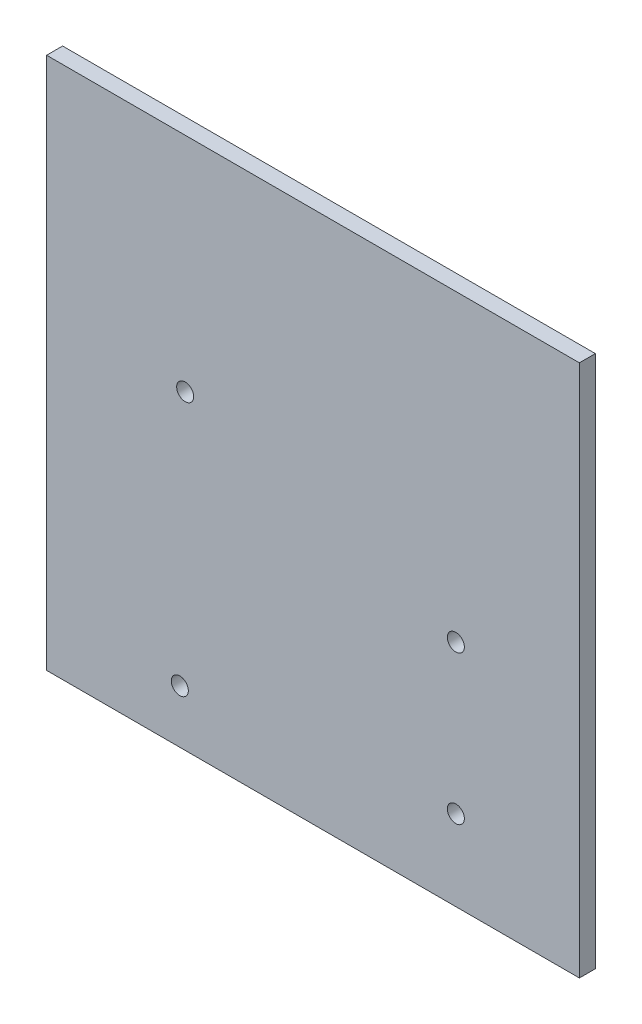
ISO-10303-21;
HEADER;
FILE_DESCRIPTION(('STEP AP214'),'2;1');
FILE_NAME('part.step','',(''),(''),'','','');
FILE_SCHEMA(('AUTOMOTIVE_DESIGN { 1 0 10303 214 1 1 1 1 }'));
ENDSEC;
DATA;
#1=APPLICATION_CONTEXT('core data for automotive mechanical design processes');
#2=APPLICATION_PROTOCOL_DEFINITION('international standard','automotive_design',2000,#1);
#3=PRODUCT_CONTEXT('',#1,'mechanical');
#4=PRODUCT('Part','Part','',(#3));
#5=PRODUCT_RELATED_PRODUCT_CATEGORY('part','',(#4));
#6=PRODUCT_DEFINITION_FORMATION('','',#4);
#7=PRODUCT_DEFINITION_CONTEXT('part definition',#1,'design');
#8=PRODUCT_DEFINITION('design','',#6,#7);
#9=PRODUCT_DEFINITION_SHAPE('','',#8);
#10=(LENGTH_UNIT() NAMED_UNIT(*) SI_UNIT(.MILLI.,.METRE.));
#11=(NAMED_UNIT(*) PLANE_ANGLE_UNIT() SI_UNIT($,.RADIAN.));
#12=(NAMED_UNIT(*) SI_UNIT($,.STERADIAN.) SOLID_ANGLE_UNIT());
#13=UNCERTAINTY_MEASURE_WITH_UNIT(LENGTH_MEASURE(1.E-05),#10,'distance_accuracy_value','');
#14=(GEOMETRIC_REPRESENTATION_CONTEXT(3) GLOBAL_UNCERTAINTY_ASSIGNED_CONTEXT((#13)) GLOBAL_UNIT_ASSIGNED_CONTEXT((#10,
#11,#12)) REPRESENTATION_CONTEXT('',''));
#15=CARTESIAN_POINT('',(0.,0.,0.));
#16=DIRECTION('',(0.,0.,1.));
#17=DIRECTION('',(1.,0.,0.));
#18=AXIS2_PLACEMENT_3D('',#15,#16,#17);
#19=CARTESIAN_POINT('',(50.,50.,3.));
#20=DIRECTION('',(-1.,0.,0.));
#21=DIRECTION('',(0.,-1.,0.));
#22=AXIS2_PLACEMENT_3D('',#19,#20,#21);
#23=PLANE('',#22);
#24=DIRECTION('',(0.,1.,0.));
#25=VECTOR('',#24,1.);
#26=CARTESIAN_POINT('',(50.,50.,0.));
#27=LINE('',#26,#25);
#28=CARTESIAN_POINT('',(50.,-50.,0.));
#29=VERTEX_POINT('',#28);
#30=CARTESIAN_POINT('',(50.,50.,0.));
#31=VERTEX_POINT('',#30);
#32=EDGE_CURVE('E103',#29,#31,#27,.T.);
#33=ORIENTED_EDGE('',*,*,#32,.T.);
#34=DIRECTION('',(0.,0.,-1.));
#35=VECTOR('',#34,1.);
#36=CARTESIAN_POINT('',(50.,50.,3.));
#37=LINE('',#36,#35);
#38=CARTESIAN_POINT('',(50.,50.,3.));
#39=VERTEX_POINT('',#38);
#40=EDGE_CURVE('E11',#39,#31,#37,.T.);
#41=ORIENTED_EDGE('',*,*,#40,.F.);
#42=DIRECTION('',(0.,1.,0.));
#43=VECTOR('',#42,1.);
#44=CARTESIAN_POINT('',(50.,50.,3.));
#45=LINE('',#44,#43);
#46=CARTESIAN_POINT('',(50.,-50.,3.));
#47=VERTEX_POINT('',#46);
#48=EDGE_CURVE('E90',#47,#39,#45,.T.);
#49=ORIENTED_EDGE('',*,*,#48,.F.);
#50=DIRECTION('',(0.,0.,-1.));
#51=VECTOR('',#50,1.);
#52=CARTESIAN_POINT('',(50.,-50.,3.));
#53=LINE('',#52,#51);
#54=EDGE_CURVE('E99',#47,#29,#53,.T.);
#55=ORIENTED_EDGE('',*,*,#54,.T.);
#56=EDGE_LOOP('',(#33,#41,#49,#55));
#57=FACE_BOUND('',#56,.T.);
#58=ADVANCED_FACE('F37',(#57),#23,.F.);
#59=CARTESIAN_POINT('',(-50.,50.,3.));
#60=DIRECTION('',(0.,-1.,0.));
#61=DIRECTION('',(1.,0.,0.));
#62=AXIS2_PLACEMENT_3D('',#59,#60,#61);
#63=PLANE('',#62);
#64=DIRECTION('',(-1.,0.,0.));
#65=VECTOR('',#64,1.);
#66=CARTESIAN_POINT('',(-50.,50.,0.));
#67=LINE('',#66,#65);
#68=CARTESIAN_POINT('',(-50.,50.,0.));
#69=VERTEX_POINT('',#68);
#70=EDGE_CURVE('E94',#31,#69,#67,.T.);
#71=ORIENTED_EDGE('',*,*,#70,.T.);
#72=DIRECTION('',(0.,0.,-1.));
#73=VECTOR('',#72,1.);
#74=CARTESIAN_POINT('',(-50.,50.,3.));
#75=LINE('',#74,#73);
#76=CARTESIAN_POINT('',(-50.,50.,3.));
#77=VERTEX_POINT('',#76);
#78=EDGE_CURVE('E46',#77,#69,#75,.T.);
#79=ORIENTED_EDGE('',*,*,#78,.F.);
#80=DIRECTION('',(-1.,0.,0.));
#81=VECTOR('',#80,1.);
#82=CARTESIAN_POINT('',(-50.,50.,3.));
#83=LINE('',#82,#81);
#84=EDGE_CURVE('E85',#39,#77,#83,.T.);
#85=ORIENTED_EDGE('',*,*,#84,.F.);
#86=ORIENTED_EDGE('',*,*,#40,.T.);
#87=EDGE_LOOP('',(#71,#79,#85,#86));
#88=FACE_BOUND('',#87,.T.);
#89=ADVANCED_FACE('F93',(#88),#63,.F.);
#90=CARTESIAN_POINT('',(-50.,50.,3.));
#91=DIRECTION('',(1.,0.,0.));
#92=DIRECTION('',(0.,1.,0.));
#93=AXIS2_PLACEMENT_3D('',#90,#91,#92);
#94=PLANE('',#93);
#95=DIRECTION('',(0.,-1.,0.));
#96=VECTOR('',#95,1.);
#97=CARTESIAN_POINT('',(-50.,50.,0.));
#98=LINE('',#97,#96);
#99=CARTESIAN_POINT('',(-50.,-50.,0.));
#100=VERTEX_POINT('',#99);
#101=EDGE_CURVE('E72',#69,#100,#98,.T.);
#102=ORIENTED_EDGE('',*,*,#101,.T.);
#103=DIRECTION('',(0.,0.,-1.));
#104=VECTOR('',#103,1.);
#105=CARTESIAN_POINT('',(-50.,-50.,3.));
#106=LINE('',#105,#104);
#107=CARTESIAN_POINT('',(-50.,-50.,3.));
#108=VERTEX_POINT('',#107);
#109=EDGE_CURVE('E95',#108,#100,#106,.T.);
#110=ORIENTED_EDGE('',*,*,#109,.F.);
#111=DIRECTION('',(0.,-1.,0.));
#112=VECTOR('',#111,1.);
#113=CARTESIAN_POINT('',(-50.,50.,3.));
#114=LINE('',#113,#112);
#115=EDGE_CURVE('E88',#77,#108,#114,.T.);
#116=ORIENTED_EDGE('',*,*,#115,.F.);
#117=ORIENTED_EDGE('',*,*,#78,.T.);
#118=EDGE_LOOP('',(#102,#110,#116,#117));
#119=FACE_BOUND('',#118,.T.);
#120=ADVANCED_FACE('F97',(#119),#94,.F.);
#121=CARTESIAN_POINT('',(-50.,-50.,3.));
#122=DIRECTION('',(0.,1.,0.));
#123=DIRECTION('',(-1.,0.,0.));
#124=AXIS2_PLACEMENT_3D('',#121,#122,#123);
#125=PLANE('',#124);
#126=DIRECTION('',(1.,0.,0.));
#127=VECTOR('',#126,1.);
#128=CARTESIAN_POINT('',(-50.,-50.,0.));
#129=LINE('',#128,#127);
#130=EDGE_CURVE('E78',#100,#29,#129,.T.);
#131=ORIENTED_EDGE('',*,*,#130,.T.);
#132=ORIENTED_EDGE('',*,*,#54,.F.);
#133=DIRECTION('',(1.,0.,0.));
#134=VECTOR('',#133,1.);
#135=CARTESIAN_POINT('',(-50.,-50.,3.));
#136=LINE('',#135,#134);
#137=EDGE_CURVE('E55',#108,#47,#136,.T.);
#138=ORIENTED_EDGE('',*,*,#137,.F.);
#139=ORIENTED_EDGE('',*,*,#109,.T.);
#140=EDGE_LOOP('',(#131,#132,#138,#139));
#141=FACE_BOUND('',#140,.T.);
#142=ADVANCED_FACE('F154',(#141),#125,.F.);
#143=CARTESIAN_POINT('',(0.,0.,3.));
#144=DIRECTION('',(0.,0.,1.));
#145=DIRECTION('',(1.,0.,0.));
#146=AXIS2_PLACEMENT_3D('',#143,#144,#145);
#147=PLANE('',#146);
#148=CARTESIAN_POINT('',(-23.9925225828861,8.28949149922791,3.));
#149=DIRECTION('',(0.,0.,1.));
#150=DIRECTION('',(1.,0.,0.));
#151=AXIS2_PLACEMENT_3D('',#148,#149,#150);
#152=CIRCLE('',#151,1.6);
#153=CARTESIAN_POINT('',(-22.3925225828861,8.28949149922791,3.));
#154=VERTEX_POINT('',#153);
#155=EDGE_CURVE('E227',#154,#154,#152,.T.);
#156=ORIENTED_EDGE('',*,*,#155,.F.);
#157=EDGE_LOOP('',(#156));
#158=FACE_BOUND('',#157,.T.);
#159=CARTESIAN_POINT('',(-25.,-40.,3.));
#160=DIRECTION('',(0.,0.,1.));
#161=DIRECTION('',(1.,0.,0.));
#162=AXIS2_PLACEMENT_3D('',#159,#160,#161);
#163=CIRCLE('',#162,1.6);
#164=CARTESIAN_POINT('',(-23.4,-40.,3.));
#165=VERTEX_POINT('',#164);
#166=EDGE_CURVE('E222',#165,#165,#163,.T.);
#167=ORIENTED_EDGE('',*,*,#166,.F.);
#168=EDGE_LOOP('',(#167));
#169=FACE_BOUND('',#168,.T.);
#170=CARTESIAN_POINT('',(26.8074774171139,-7.00000000000002,3.));
#171=DIRECTION('',(0.,0.,1.));
#172=DIRECTION('',(1.,0.,0.));
#173=AXIS2_PLACEMENT_3D('',#170,#171,#172);
#174=CIRCLE('',#173,1.6);
#175=CARTESIAN_POINT('',(28.4074774171139,-7.00000000000002,3.));
#176=VERTEX_POINT('',#175);
#177=EDGE_CURVE('E215',#176,#176,#174,.T.);
#178=ORIENTED_EDGE('',*,*,#177,.F.);
#179=EDGE_LOOP('',(#178));
#180=FACE_BOUND('',#179,.T.);
#181=CARTESIAN_POINT('',(26.8074774171139,-34.9,3.));
#182=DIRECTION('',(0.,0.,1.));
#183=DIRECTION('',(1.,0.,0.));
#184=AXIS2_PLACEMENT_3D('',#181,#182,#183);
#185=CIRCLE('',#184,1.6);
#186=CARTESIAN_POINT('',(28.4074774171139,-34.9,3.));
#187=VERTEX_POINT('',#186);
#188=EDGE_CURVE('E115',#187,#187,#185,.T.);
#189=ORIENTED_EDGE('',*,*,#188,.F.);
#190=EDGE_LOOP('',(#189));
#191=FACE_BOUND('',#190,.T.);
#192=ORIENTED_EDGE('',*,*,#48,.T.);
#193=ORIENTED_EDGE('',*,*,#84,.T.);
#194=ORIENTED_EDGE('',*,*,#115,.T.);
#195=ORIENTED_EDGE('',*,*,#137,.T.);
#196=EDGE_LOOP('',(#192,#193,#194,#195));
#197=FACE_BOUND('',#196,.T.);
#198=ADVANCED_FACE('F86',(#158,#169,#180,#191,#197),#147,.T.);
#199=CARTESIAN_POINT('',(0.,0.,0.));
#200=DIRECTION('',(0.,0.,1.));
#201=DIRECTION('',(1.,0.,0.));
#202=AXIS2_PLACEMENT_3D('',#199,#200,#201);
#203=PLANE('',#202);
#204=CARTESIAN_POINT('',(-23.9925225828861,8.28949149922791,0.));
#205=DIRECTION('',(0.,0.,1.));
#206=DIRECTION('',(1.,0.,0.));
#207=AXIS2_PLACEMENT_3D('',#204,#205,#206);
#208=CIRCLE('',#207,1.6);
#209=CARTESIAN_POINT('',(-22.3925225828861,8.28949149922791,0.));
#210=VERTEX_POINT('',#209);
#211=EDGE_CURVE('E40',#210,#210,#208,.T.);
#212=ORIENTED_EDGE('',*,*,#211,.T.);
#213=EDGE_LOOP('',(#212));
#214=FACE_BOUND('',#213,.T.);
#215=CARTESIAN_POINT('',(-25.,-40.,0.));
#216=DIRECTION('',(0.,0.,1.));
#217=DIRECTION('',(1.,0.,0.));
#218=AXIS2_PLACEMENT_3D('',#215,#216,#217);
#219=CIRCLE('',#218,1.6);
#220=CARTESIAN_POINT('',(-23.4,-40.,0.));
#221=VERTEX_POINT('',#220);
#222=EDGE_CURVE('E117',#221,#221,#219,.T.);
#223=ORIENTED_EDGE('',*,*,#222,.T.);
#224=EDGE_LOOP('',(#223));
#225=FACE_BOUND('',#224,.T.);
#226=CARTESIAN_POINT('',(26.8074774171139,-7.00000000000002,0.));
#227=DIRECTION('',(0.,0.,1.));
#228=DIRECTION('',(1.,0.,0.));
#229=AXIS2_PLACEMENT_3D('',#226,#227,#228);
#230=CIRCLE('',#229,1.6);
#231=CARTESIAN_POINT('',(28.4074774171139,-7.00000000000002,0.));
#232=VERTEX_POINT('',#231);
#233=EDGE_CURVE('E114',#232,#232,#230,.T.);
#234=ORIENTED_EDGE('',*,*,#233,.T.);
#235=EDGE_LOOP('',(#234));
#236=FACE_BOUND('',#235,.T.);
#237=CARTESIAN_POINT('',(26.8074774171139,-34.9,0.));
#238=DIRECTION('',(0.,0.,1.));
#239=DIRECTION('',(1.,0.,0.));
#240=AXIS2_PLACEMENT_3D('',#237,#238,#239);
#241=CIRCLE('',#240,1.6);
#242=CARTESIAN_POINT('',(28.4074774171139,-34.9,0.));
#243=VERTEX_POINT('',#242);
#244=EDGE_CURVE('E111',#243,#243,#241,.T.);
#245=ORIENTED_EDGE('',*,*,#244,.T.);
#246=EDGE_LOOP('',(#245));
#247=FACE_BOUND('',#246,.T.);
#248=ORIENTED_EDGE('',*,*,#32,.F.);
#249=ORIENTED_EDGE('',*,*,#130,.F.);
#250=ORIENTED_EDGE('',*,*,#101,.F.);
#251=ORIENTED_EDGE('',*,*,#70,.F.);
#252=EDGE_LOOP('',(#248,#249,#250,#251));
#253=FACE_BOUND('',#252,.T.);
#254=ADVANCED_FACE('F124',(#214,#225,#236,#247,#253),#203,.F.);
#255=CARTESIAN_POINT('',(26.8074774171139,-34.9,-56.));
#256=DIRECTION('',(0.,0.,1.));
#257=DIRECTION('',(1.,0.,0.));
#258=AXIS2_PLACEMENT_3D('',#255,#256,#257);
#259=CYLINDRICAL_SURFACE('',#258,1.6);
#260=ORIENTED_EDGE('',*,*,#188,.T.);
#261=EDGE_LOOP('',(#260));
#262=FACE_BOUND('',#261,.T.);
#263=ORIENTED_EDGE('',*,*,#244,.F.);
#264=EDGE_LOOP('',(#263));
#265=FACE_BOUND('',#264,.T.);
#266=ADVANCED_FACE('F147',(#262,#265),#259,.F.);
#267=CARTESIAN_POINT('',(26.8074774171139,-7.00000000000002,-56.));
#268=DIRECTION('',(0.,0.,1.));
#269=DIRECTION('',(1.,0.,0.));
#270=AXIS2_PLACEMENT_3D('',#267,#268,#269);
#271=CYLINDRICAL_SURFACE('',#270,1.6);
#272=ORIENTED_EDGE('',*,*,#177,.T.);
#273=EDGE_LOOP('',(#272));
#274=FACE_BOUND('',#273,.T.);
#275=ORIENTED_EDGE('',*,*,#233,.F.);
#276=EDGE_LOOP('',(#275));
#277=FACE_BOUND('',#276,.T.);
#278=ADVANCED_FACE('F134',(#274,#277),#271,.F.);
#279=CARTESIAN_POINT('',(-25.,-40.,-56.));
#280=DIRECTION('',(0.,0.,1.));
#281=DIRECTION('',(1.,0.,0.));
#282=AXIS2_PLACEMENT_3D('',#279,#280,#281);
#283=CYLINDRICAL_SURFACE('',#282,1.6);
#284=ORIENTED_EDGE('',*,*,#166,.T.);
#285=EDGE_LOOP('',(#284));
#286=FACE_BOUND('',#285,.T.);
#287=ORIENTED_EDGE('',*,*,#222,.F.);
#288=EDGE_LOOP('',(#287));
#289=FACE_BOUND('',#288,.T.);
#290=ADVANCED_FACE('F128',(#286,#289),#283,.F.);
#291=CARTESIAN_POINT('',(-23.9925225828861,8.28949149922791,-56.));
#292=DIRECTION('',(0.,0.,1.));
#293=DIRECTION('',(1.,0.,0.));
#294=AXIS2_PLACEMENT_3D('',#291,#292,#293);
#295=CYLINDRICAL_SURFACE('',#294,1.6);
#296=ORIENTED_EDGE('',*,*,#155,.T.);
#297=EDGE_LOOP('',(#296));
#298=FACE_BOUND('',#297,.T.);
#299=ORIENTED_EDGE('',*,*,#211,.F.);
#300=EDGE_LOOP('',(#299));
#301=FACE_BOUND('',#300,.T.);
#302=ADVANCED_FACE('F126',(#298,#301),#295,.F.);
#303=CLOSED_SHELL('',(#58,#89,#120,#142,#198,#254,#266,#278,#290,#302));
#304=MANIFOLD_SOLID_BREP('B2',#303);
#305=ADVANCED_BREP_SHAPE_REPRESENTATION('',(#18,#304),#14);
#306=SHAPE_DEFINITION_REPRESENTATION(#9,#305);
ENDSEC;
END-ISO-10303-21;
